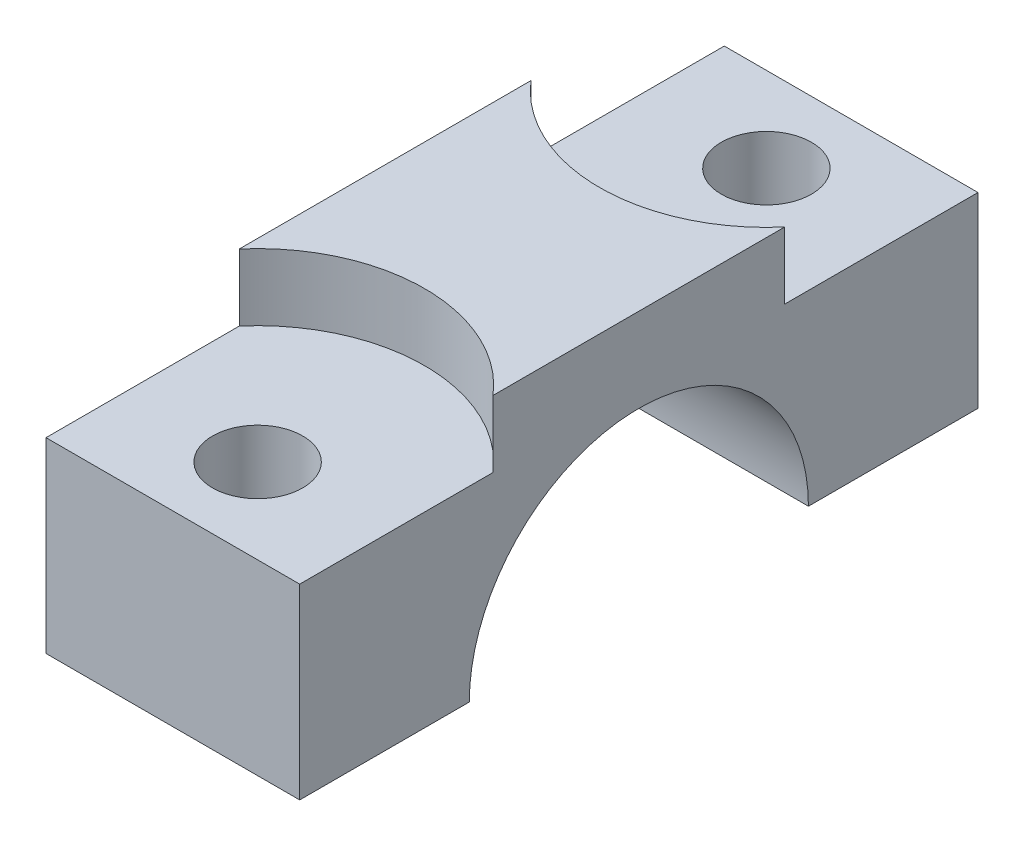
ISO-10303-21;
HEADER;
FILE_DESCRIPTION(('STEP AP214'),'2;1');
FILE_NAME('part.step','',(''),(''),'','','');
FILE_SCHEMA(('AUTOMOTIVE_DESIGN { 1 0 10303 214 1 1 1 1 }'));
ENDSEC;
DATA;
#1=APPLICATION_CONTEXT('core data for automotive mechanical design processes');
#2=APPLICATION_PROTOCOL_DEFINITION('international standard','automotive_design',2000,#1);
#3=PRODUCT_CONTEXT('',#1,'mechanical');
#4=PRODUCT('Part','Part','',(#3));
#5=PRODUCT_RELATED_PRODUCT_CATEGORY('part','',(#4));
#6=PRODUCT_DEFINITION_FORMATION('','',#4);
#7=PRODUCT_DEFINITION_CONTEXT('part definition',#1,'design');
#8=PRODUCT_DEFINITION('design','',#6,#7);
#9=PRODUCT_DEFINITION_SHAPE('','',#8);
#10=(LENGTH_UNIT() NAMED_UNIT(*) SI_UNIT(.MILLI.,.METRE.));
#11=(NAMED_UNIT(*) PLANE_ANGLE_UNIT() SI_UNIT($,.RADIAN.));
#12=(NAMED_UNIT(*) SI_UNIT($,.STERADIAN.) SOLID_ANGLE_UNIT());
#13=UNCERTAINTY_MEASURE_WITH_UNIT(LENGTH_MEASURE(1.E-05),#10,'distance_accuracy_value','');
#14=(GEOMETRIC_REPRESENTATION_CONTEXT(3) GLOBAL_UNCERTAINTY_ASSIGNED_CONTEXT((#13)) GLOBAL_UNIT_ASSIGNED_CONTEXT((#10,
#11,#12)) REPRESENTATION_CONTEXT('',''));
#15=CARTESIAN_POINT('',(0.,0.,0.));
#16=DIRECTION('',(0.,0.,1.));
#17=DIRECTION('',(1.,0.,0.));
#18=AXIS2_PLACEMENT_3D('',#15,#16,#17);
#19=CARTESIAN_POINT('',(9.5,0.,0.));
#20=DIRECTION('',(-1.,0.,0.));
#21=DIRECTION('',(0.,0.,1.));
#22=AXIS2_PLACEMENT_3D('',#19,#20,#21);
#23=CYLINDRICAL_SURFACE('',#22,12.7);
#24=CARTESIAN_POINT('',(-9.5,0.,0.));
#25=DIRECTION('',(1.,0.,0.));
#26=DIRECTION('',(0.,0.,-1.));
#27=AXIS2_PLACEMENT_3D('',#24,#25,#26);
#28=CIRCLE('',#27,12.7);
#29=CARTESIAN_POINT('',(-9.5,0.,-12.7));
#30=VERTEX_POINT('',#29);
#31=CARTESIAN_POINT('',(-9.5,0.,12.7));
#32=VERTEX_POINT('',#31);
#33=EDGE_CURVE('E135',#30,#32,#28,.T.);
#34=ORIENTED_EDGE('',*,*,#33,.F.);
#35=DIRECTION('',(-1.,0.,0.));
#36=VECTOR('',#35,1.);
#37=CARTESIAN_POINT('',(9.5,0.,-12.7));
#38=LINE('',#37,#36);
#39=CARTESIAN_POINT('',(9.5,0.,-12.7));
#40=VERTEX_POINT('',#39);
#41=EDGE_CURVE('E156',#40,#30,#38,.T.);
#42=ORIENTED_EDGE('',*,*,#41,.F.);
#43=CARTESIAN_POINT('',(9.5,0.,0.));
#44=DIRECTION('',(1.,0.,0.));
#45=DIRECTION('',(0.,0.,-1.));
#46=AXIS2_PLACEMENT_3D('',#43,#44,#45);
#47=CIRCLE('',#46,12.7);
#48=CARTESIAN_POINT('',(9.5,0.,12.7));
#49=VERTEX_POINT('',#48);
#50=EDGE_CURVE('E202',#40,#49,#47,.T.);
#51=ORIENTED_EDGE('',*,*,#50,.T.);
#52=DIRECTION('',(-1.,0.,0.));
#53=VECTOR('',#52,1.);
#54=CARTESIAN_POINT('',(9.5,0.,12.7));
#55=LINE('',#54,#53);
#56=EDGE_CURVE('E149',#49,#32,#55,.T.);
#57=ORIENTED_EDGE('',*,*,#56,.T.);
#58=EDGE_LOOP('',(#34,#42,#51,#57));
#59=FACE_BOUND('',#58,.T.);
#60=ADVANCED_FACE('F35',(#59),#23,.F.);
#61=CARTESIAN_POINT('',(9.5,0.,0.));
#62=DIRECTION('',(0.,1.,0.));
#63=DIRECTION('',(0.,0.,1.));
#64=AXIS2_PLACEMENT_3D('',#61,#62,#63);
#65=PLANE('',#64);
#66=CARTESIAN_POINT('',(0.,0.,-19.05));
#67=DIRECTION('',(0.,1.,0.));
#68=DIRECTION('',(0.,0.,1.));
#69=AXIS2_PLACEMENT_3D('',#66,#67,#68);
#70=CIRCLE('',#69,3.375);
#71=CARTESIAN_POINT('',(0.,0.,-15.675));
#72=VERTEX_POINT('',#71);
#73=EDGE_CURVE('E194',#72,#72,#70,.T.);
#74=ORIENTED_EDGE('',*,*,#73,.T.);
#75=EDGE_LOOP('',(#74));
#76=FACE_BOUND('',#75,.T.);
#77=DIRECTION('',(0.,0.,-1.));
#78=VECTOR('',#77,1.);
#79=CARTESIAN_POINT('',(-9.5,0.,0.));
#80=LINE('',#79,#78);
#81=CARTESIAN_POINT('',(-9.5,0.,-25.4));
#82=VERTEX_POINT('',#81);
#83=EDGE_CURVE('E138',#30,#82,#80,.T.);
#84=ORIENTED_EDGE('',*,*,#83,.T.);
#85=DIRECTION('',(-1.,0.,0.));
#86=VECTOR('',#85,1.);
#87=CARTESIAN_POINT('',(9.5,0.,-25.4));
#88=LINE('',#87,#86);
#89=CARTESIAN_POINT('',(9.5,0.,-25.4));
#90=VERTEX_POINT('',#89);
#91=EDGE_CURVE('E153',#90,#82,#88,.T.);
#92=ORIENTED_EDGE('',*,*,#91,.F.);
#93=DIRECTION('',(0.,0.,-1.));
#94=VECTOR('',#93,1.);
#95=CARTESIAN_POINT('',(9.5,0.,0.));
#96=LINE('',#95,#94);
#97=EDGE_CURVE('E131',#40,#90,#96,.T.);
#98=ORIENTED_EDGE('',*,*,#97,.F.);
#99=ORIENTED_EDGE('',*,*,#41,.T.);
#100=EDGE_LOOP('',(#84,#92,#98,#99));
#101=FACE_BOUND('',#100,.T.);
#102=ADVANCED_FACE('F216',(#76,#101),#65,.F.);
#103=CARTESIAN_POINT('',(9.5,0.,-25.4));
#104=DIRECTION('',(0.,0.,1.));
#105=DIRECTION('',(0.,-1.,0.));
#106=AXIS2_PLACEMENT_3D('',#103,#104,#105);
#107=PLANE('',#106);
#108=DIRECTION('',(0.,1.,0.));
#109=VECTOR('',#108,1.);
#110=CARTESIAN_POINT('',(-9.5,0.,-25.4));
#111=LINE('',#110,#109);
#112=CARTESIAN_POINT('',(-9.5,14.,-25.4));
#113=VERTEX_POINT('',#112);
#114=EDGE_CURVE('E141',#82,#113,#111,.T.);
#115=ORIENTED_EDGE('',*,*,#114,.T.);
#116=DIRECTION('',(1.,0.,0.));
#117=VECTOR('',#116,1.);
#118=CARTESIAN_POINT('',(9.5,14.,-25.4));
#119=LINE('',#118,#117);
#120=CARTESIAN_POINT('',(9.5,14.,-25.4));
#121=VERTEX_POINT('',#120);
#122=EDGE_CURVE('E139',#113,#121,#119,.T.);
#123=ORIENTED_EDGE('',*,*,#122,.T.);
#124=DIRECTION('',(0.,1.,0.));
#125=VECTOR('',#124,1.);
#126=CARTESIAN_POINT('',(9.5,0.,-25.4));
#127=LINE('',#126,#125);
#128=EDGE_CURVE('E125',#90,#121,#127,.T.);
#129=ORIENTED_EDGE('',*,*,#128,.F.);
#130=ORIENTED_EDGE('',*,*,#91,.T.);
#131=EDGE_LOOP('',(#115,#123,#129,#130));
#132=FACE_BOUND('',#131,.T.);
#133=ADVANCED_FACE('F220',(#132),#107,.F.);
#134=CARTESIAN_POINT('',(9.5,19.,0.));
#135=DIRECTION('',(0.,1.,0.));
#136=DIRECTION('',(0.,0.,1.));
#137=AXIS2_PLACEMENT_3D('',#134,#135,#136);
#138=PLANE('',#137);
#139=CARTESIAN_POINT('',(0.,19.,19.05));
#140=DIRECTION('',(0.,1.,0.));
#141=DIRECTION('',(0.,0.,1.));
#142=AXIS2_PLACEMENT_3D('',#139,#140,#141);
#143=CIRCLE('',#142,12.5);
#144=CARTESIAN_POINT('',(9.5,19.,10.925961595364));
#145=VERTEX_POINT('',#144);
#146=CARTESIAN_POINT('',(-9.5,19.,10.925961595364));
#147=VERTEX_POINT('',#146);
#148=EDGE_CURVE('E111',#145,#147,#143,.T.);
#149=ORIENTED_EDGE('',*,*,#148,.F.);
#150=DIRECTION('',(0.,0.,-1.));
#151=VECTOR('',#150,1.);
#152=CARTESIAN_POINT('',(9.5,19.,0.));
#153=LINE('',#152,#151);
#154=CARTESIAN_POINT('',(9.5,19.,-10.925961595364));
#155=VERTEX_POINT('',#154);
#156=EDGE_CURVE('E56',#145,#155,#153,.T.);
#157=ORIENTED_EDGE('',*,*,#156,.T.);
#158=CARTESIAN_POINT('',(0.,19.,-19.05));
#159=DIRECTION('',(0.,1.,0.));
#160=DIRECTION('',(0.,0.,1.));
#161=AXIS2_PLACEMENT_3D('',#158,#159,#160);
#162=CIRCLE('',#161,12.5);
#163=CARTESIAN_POINT('',(-9.5,19.,-10.925961595364));
#164=VERTEX_POINT('',#163);
#165=EDGE_CURVE('E179',#164,#155,#162,.T.);
#166=ORIENTED_EDGE('',*,*,#165,.F.);
#167=DIRECTION('',(0.,0.,-1.));
#168=VECTOR('',#167,1.);
#169=CARTESIAN_POINT('',(-9.5,19.,0.));
#170=LINE('',#169,#168);
#171=EDGE_CURVE('E118',#147,#164,#170,.T.);
#172=ORIENTED_EDGE('',*,*,#171,.F.);
#173=EDGE_LOOP('',(#149,#157,#166,#172));
#174=FACE_BOUND('',#173,.T.);
#175=ADVANCED_FACE('F117',(#174),#138,.T.);
#176=CARTESIAN_POINT('',(9.5,0.,25.4));
#177=DIRECTION('',(0.,0.,1.));
#178=DIRECTION('',(1.,0.,0.));
#179=AXIS2_PLACEMENT_3D('',#176,#177,#178);
#180=PLANE('',#179);
#181=DIRECTION('',(1.,0.,0.));
#182=VECTOR('',#181,1.);
#183=CARTESIAN_POINT('',(9.5,14.,25.4));
#184=LINE('',#183,#182);
#185=CARTESIAN_POINT('',(-9.5,14.,25.4));
#186=VERTEX_POINT('',#185);
#187=CARTESIAN_POINT('',(9.5,14.,25.4));
#188=VERTEX_POINT('',#187);
#189=EDGE_CURVE('E175',#186,#188,#184,.T.);
#190=ORIENTED_EDGE('',*,*,#189,.F.);
#191=DIRECTION('',(0.,1.,0.));
#192=VECTOR('',#191,1.);
#193=CARTESIAN_POINT('',(-9.5,0.,25.4));
#194=LINE('',#193,#192);
#195=CARTESIAN_POINT('',(-9.5,0.,25.4));
#196=VERTEX_POINT('',#195);
#197=EDGE_CURVE('E146',#196,#186,#194,.T.);
#198=ORIENTED_EDGE('',*,*,#197,.F.);
#199=DIRECTION('',(-1.,0.,0.));
#200=VECTOR('',#199,1.);
#201=CARTESIAN_POINT('',(9.5,0.,25.4));
#202=LINE('',#201,#200);
#203=CARTESIAN_POINT('',(9.5,0.,25.4));
#204=VERTEX_POINT('',#203);
#205=EDGE_CURVE('E151',#204,#196,#202,.T.);
#206=ORIENTED_EDGE('',*,*,#205,.F.);
#207=DIRECTION('',(0.,1.,0.));
#208=VECTOR('',#207,1.);
#209=CARTESIAN_POINT('',(9.5,0.,25.4));
#210=LINE('',#209,#208);
#211=EDGE_CURVE('E124',#204,#188,#210,.T.);
#212=ORIENTED_EDGE('',*,*,#211,.T.);
#213=EDGE_LOOP('',(#190,#198,#206,#212));
#214=FACE_BOUND('',#213,.T.);
#215=ADVANCED_FACE('F177',(#214),#180,.T.);
#216=CARTESIAN_POINT('',(0.,0.,19.05));
#217=DIRECTION('',(0.,1.,0.));
#218=DIRECTION('',(0.,0.,1.));
#219=AXIS2_PLACEMENT_3D('',#216,#217,#218);
#220=CIRCLE('',#219,3.375);
#221=CARTESIAN_POINT('',(0.,0.,22.425));
#222=VERTEX_POINT('',#221);
#223=EDGE_CURVE('E180',#222,#222,#220,.T.);
#224=ORIENTED_EDGE('',*,*,#223,.T.);
#225=EDGE_LOOP('',(#224));
#226=FACE_BOUND('',#225,.T.);
#227=EDGE_CURVE('E142',#196,#32,#80,.T.);
#228=ORIENTED_EDGE('',*,*,#227,.T.);
#229=ORIENTED_EDGE('',*,*,#56,.F.);
#230=EDGE_CURVE('E128',#204,#49,#96,.T.);
#231=ORIENTED_EDGE('',*,*,#230,.F.);
#232=ORIENTED_EDGE('',*,*,#205,.T.);
#233=EDGE_LOOP('',(#228,#229,#231,#232));
#234=FACE_BOUND('',#233,.T.);
#235=ADVANCED_FACE('F211',(#226,#234),#65,.F.);
#236=CARTESIAN_POINT('',(9.5,0.,0.));
#237=DIRECTION('',(1.,0.,0.));
#238=DIRECTION('',(0.,0.,-1.));
#239=AXIS2_PLACEMENT_3D('',#236,#237,#238);
#240=PLANE('',#239);
#241=DIRECTION('',(0.,0.,-1.));
#242=VECTOR('',#241,1.);
#243=CARTESIAN_POINT('',(9.5,14.,0.));
#244=LINE('',#243,#242);
#245=CARTESIAN_POINT('',(9.5,14.,10.925961595364));
#246=VERTEX_POINT('',#245);
#247=EDGE_CURVE('E11',#188,#246,#244,.T.);
#248=ORIENTED_EDGE('',*,*,#247,.F.);
#249=ORIENTED_EDGE('',*,*,#211,.F.);
#250=ORIENTED_EDGE('',*,*,#230,.T.);
#251=ORIENTED_EDGE('',*,*,#50,.F.);
#252=ORIENTED_EDGE('',*,*,#97,.T.);
#253=ORIENTED_EDGE('',*,*,#128,.T.);
#254=DIRECTION('',(0.,0.,-1.));
#255=VECTOR('',#254,1.);
#256=CARTESIAN_POINT('',(9.5,14.,0.));
#257=LINE('',#256,#255);
#258=CARTESIAN_POINT('',(9.5,14.,-10.925961595364));
#259=VERTEX_POINT('',#258);
#260=EDGE_CURVE('E159',#259,#121,#257,.T.);
#261=ORIENTED_EDGE('',*,*,#260,.F.);
#262=DIRECTION('',(0.,1.,0.));
#263=VECTOR('',#262,1.);
#264=CARTESIAN_POINT('',(9.5,19.,-10.925961595364));
#265=LINE('',#264,#263);
#266=EDGE_CURVE('E123',#155,#259,#265,.F.);
#267=ORIENTED_EDGE('',*,*,#266,.F.);
#268=ORIENTED_EDGE('',*,*,#156,.F.);
#269=DIRECTION('',(0.,1.,0.));
#270=VECTOR('',#269,1.);
#271=CARTESIAN_POINT('',(9.5,19.,10.925961595364));
#272=LINE('',#271,#270);
#273=EDGE_CURVE('E42',#246,#145,#272,.T.);
#274=ORIENTED_EDGE('',*,*,#273,.F.);
#275=EDGE_LOOP('',(#248,#249,#250,#251,#252,#253,#261,#267,#268,#274));
#276=FACE_BOUND('',#275,.T.);
#277=ADVANCED_FACE('F121',(#276),#240,.T.);
#278=CARTESIAN_POINT('',(-9.5,0.,0.));
#279=DIRECTION('',(1.,0.,0.));
#280=DIRECTION('',(0.,0.,-1.));
#281=AXIS2_PLACEMENT_3D('',#278,#279,#280);
#282=PLANE('',#281);
#283=ORIENTED_EDGE('',*,*,#197,.T.);
#284=DIRECTION('',(0.,0.,-1.));
#285=VECTOR('',#284,1.);
#286=CARTESIAN_POINT('',(-9.5,14.,0.));
#287=LINE('',#286,#285);
#288=CARTESIAN_POINT('',(-9.5,14.,10.925961595364));
#289=VERTEX_POINT('',#288);
#290=EDGE_CURVE('E115',#186,#289,#287,.T.);
#291=ORIENTED_EDGE('',*,*,#290,.T.);
#292=DIRECTION('',(0.,1.,0.));
#293=VECTOR('',#292,1.);
#294=CARTESIAN_POINT('',(-9.5,19.,10.925961595364));
#295=LINE('',#294,#293);
#296=EDGE_CURVE('E164',#289,#147,#295,.T.);
#297=ORIENTED_EDGE('',*,*,#296,.T.);
#298=ORIENTED_EDGE('',*,*,#171,.T.);
#299=DIRECTION('',(0.,1.,0.));
#300=VECTOR('',#299,1.);
#301=CARTESIAN_POINT('',(-9.5,19.,-10.925961595364));
#302=LINE('',#301,#300);
#303=CARTESIAN_POINT('',(-9.5,14.,-10.925961595364));
#304=VERTEX_POINT('',#303);
#305=EDGE_CURVE('E197',#164,#304,#302,.F.);
#306=ORIENTED_EDGE('',*,*,#305,.T.);
#307=DIRECTION('',(0.,0.,-1.));
#308=VECTOR('',#307,1.);
#309=CARTESIAN_POINT('',(-9.5,14.,0.));
#310=LINE('',#309,#308);
#311=EDGE_CURVE('E161',#304,#113,#310,.T.);
#312=ORIENTED_EDGE('',*,*,#311,.T.);
#313=ORIENTED_EDGE('',*,*,#114,.F.);
#314=ORIENTED_EDGE('',*,*,#83,.F.);
#315=ORIENTED_EDGE('',*,*,#33,.T.);
#316=ORIENTED_EDGE('',*,*,#227,.F.);
#317=EDGE_LOOP('',(#283,#291,#297,#298,#306,#312,#313,#314,#315,#316));
#318=FACE_BOUND('',#317,.T.);
#319=ADVANCED_FACE('F168',(#318),#282,.F.);
#320=CARTESIAN_POINT('',(0.,19.,-19.05));
#321=DIRECTION('',(0.,1.,0.));
#322=DIRECTION('',(0.,0.,1.));
#323=AXIS2_PLACEMENT_3D('',#320,#321,#322);
#324=CYLINDRICAL_SURFACE('',#323,12.5);
#325=ORIENTED_EDGE('',*,*,#165,.T.);
#326=ORIENTED_EDGE('',*,*,#266,.T.);
#327=CARTESIAN_POINT('',(0.,14.,-19.05));
#328=DIRECTION('',(0.,1.,0.));
#329=DIRECTION('',(0.,0.,1.));
#330=AXIS2_PLACEMENT_3D('',#327,#328,#329);
#331=CIRCLE('',#330,12.5);
#332=EDGE_CURVE('E182',#304,#259,#331,.T.);
#333=ORIENTED_EDGE('',*,*,#332,.F.);
#334=ORIENTED_EDGE('',*,*,#305,.F.);
#335=EDGE_LOOP('',(#325,#326,#333,#334));
#336=FACE_BOUND('',#335,.T.);
#337=ADVANCED_FACE('F227',(#336),#324,.F.);
#338=CARTESIAN_POINT('',(0.,19.,-19.05));
#339=DIRECTION('',(0.,1.,0.));
#340=DIRECTION('',(0.,0.,1.));
#341=AXIS2_PLACEMENT_3D('',#338,#339,#340);
#342=CYLINDRICAL_SURFACE('',#341,3.375);
#343=ORIENTED_EDGE('',*,*,#73,.F.);
#344=EDGE_LOOP('',(#343));
#345=FACE_BOUND('',#344,.T.);
#346=CARTESIAN_POINT('',(0.,14.,-19.05));
#347=DIRECTION('',(0.,1.,0.));
#348=DIRECTION('',(0.,0.,1.));
#349=AXIS2_PLACEMENT_3D('',#346,#347,#348);
#350=CIRCLE('',#349,3.375);
#351=CARTESIAN_POINT('',(0.,14.,-15.675));
#352=VERTEX_POINT('',#351);
#353=EDGE_CURVE('E191',#352,#352,#350,.T.);
#354=ORIENTED_EDGE('',*,*,#353,.T.);
#355=EDGE_LOOP('',(#354));
#356=FACE_BOUND('',#355,.T.);
#357=ADVANCED_FACE('F229',(#345,#356),#342,.F.);
#358=CARTESIAN_POINT('',(3.375,14.,-19.05));
#359=DIRECTION('',(0.,-1.,0.));
#360=DIRECTION('',(0.,0.,-1.));
#361=AXIS2_PLACEMENT_3D('',#358,#359,#360);
#362=PLANE('',#361);
#363=ORIENTED_EDGE('',*,*,#260,.T.);
#364=ORIENTED_EDGE('',*,*,#122,.F.);
#365=ORIENTED_EDGE('',*,*,#311,.F.);
#366=ORIENTED_EDGE('',*,*,#332,.T.);
#367=EDGE_LOOP('',(#363,#364,#365,#366));
#368=FACE_BOUND('',#367,.T.);
#369=ORIENTED_EDGE('',*,*,#353,.F.);
#370=EDGE_LOOP('',(#369));
#371=FACE_BOUND('',#370,.T.);
#372=ADVANCED_FACE('F222',(#368,#371),#362,.F.);
#373=CARTESIAN_POINT('',(0.,19.,19.05));
#374=DIRECTION('',(0.,1.,0.));
#375=DIRECTION('',(0.,0.,1.));
#376=AXIS2_PLACEMENT_3D('',#373,#374,#375);
#377=CYLINDRICAL_SURFACE('',#376,12.5);
#378=CARTESIAN_POINT('',(0.,14.,19.05));
#379=DIRECTION('',(0.,1.,0.));
#380=DIRECTION('',(0.,0.,1.));
#381=AXIS2_PLACEMENT_3D('',#378,#379,#380);
#382=CIRCLE('',#381,12.5);
#383=EDGE_CURVE('E49',#246,#289,#382,.T.);
#384=ORIENTED_EDGE('',*,*,#383,.F.);
#385=ORIENTED_EDGE('',*,*,#273,.T.);
#386=ORIENTED_EDGE('',*,*,#148,.T.);
#387=ORIENTED_EDGE('',*,*,#296,.F.);
#388=EDGE_LOOP('',(#384,#385,#386,#387));
#389=FACE_BOUND('',#388,.T.);
#390=ADVANCED_FACE('F110',(#389),#377,.F.);
#391=CARTESIAN_POINT('',(0.,19.,19.05));
#392=DIRECTION('',(0.,1.,0.));
#393=DIRECTION('',(0.,0.,1.));
#394=AXIS2_PLACEMENT_3D('',#391,#392,#393);
#395=CYLINDRICAL_SURFACE('',#394,3.375);
#396=ORIENTED_EDGE('',*,*,#223,.F.);
#397=EDGE_LOOP('',(#396));
#398=FACE_BOUND('',#397,.T.);
#399=CARTESIAN_POINT('',(0.,14.,19.05));
#400=DIRECTION('',(0.,1.,0.));
#401=DIRECTION('',(0.,0.,1.));
#402=AXIS2_PLACEMENT_3D('',#399,#400,#401);
#403=CIRCLE('',#402,3.375);
#404=CARTESIAN_POINT('',(0.,14.,22.425));
#405=VERTEX_POINT('',#404);
#406=EDGE_CURVE('E185',#405,#405,#403,.T.);
#407=ORIENTED_EDGE('',*,*,#406,.T.);
#408=EDGE_LOOP('',(#407));
#409=FACE_BOUND('',#408,.T.);
#410=ADVANCED_FACE('F259',(#398,#409),#395,.F.);
#411=CARTESIAN_POINT('',(3.375,14.,19.05));
#412=DIRECTION('',(0.,-1.,0.));
#413=DIRECTION('',(0.,0.,-1.));
#414=AXIS2_PLACEMENT_3D('',#411,#412,#413);
#415=PLANE('',#414);
#416=ORIENTED_EDGE('',*,*,#247,.T.);
#417=ORIENTED_EDGE('',*,*,#383,.T.);
#418=ORIENTED_EDGE('',*,*,#290,.F.);
#419=ORIENTED_EDGE('',*,*,#189,.T.);
#420=EDGE_LOOP('',(#416,#417,#418,#419));
#421=FACE_BOUND('',#420,.T.);
#422=ORIENTED_EDGE('',*,*,#406,.F.);
#423=EDGE_LOOP('',(#422));
#424=FACE_BOUND('',#423,.T.);
#425=ADVANCED_FACE('F173',(#421,#424),#415,.F.);
#426=CLOSED_SHELL('',(#60,#102,#133,#175,#215,#235,#277,#319,#337,#357,#372,#390,#410,#425));
#427=MANIFOLD_SOLID_BREP('B2',#426);
#428=ADVANCED_BREP_SHAPE_REPRESENTATION('',(#18,#427),#14);
#429=SHAPE_DEFINITION_REPRESENTATION(#9,#428);
ENDSEC;
END-ISO-10303-21;
